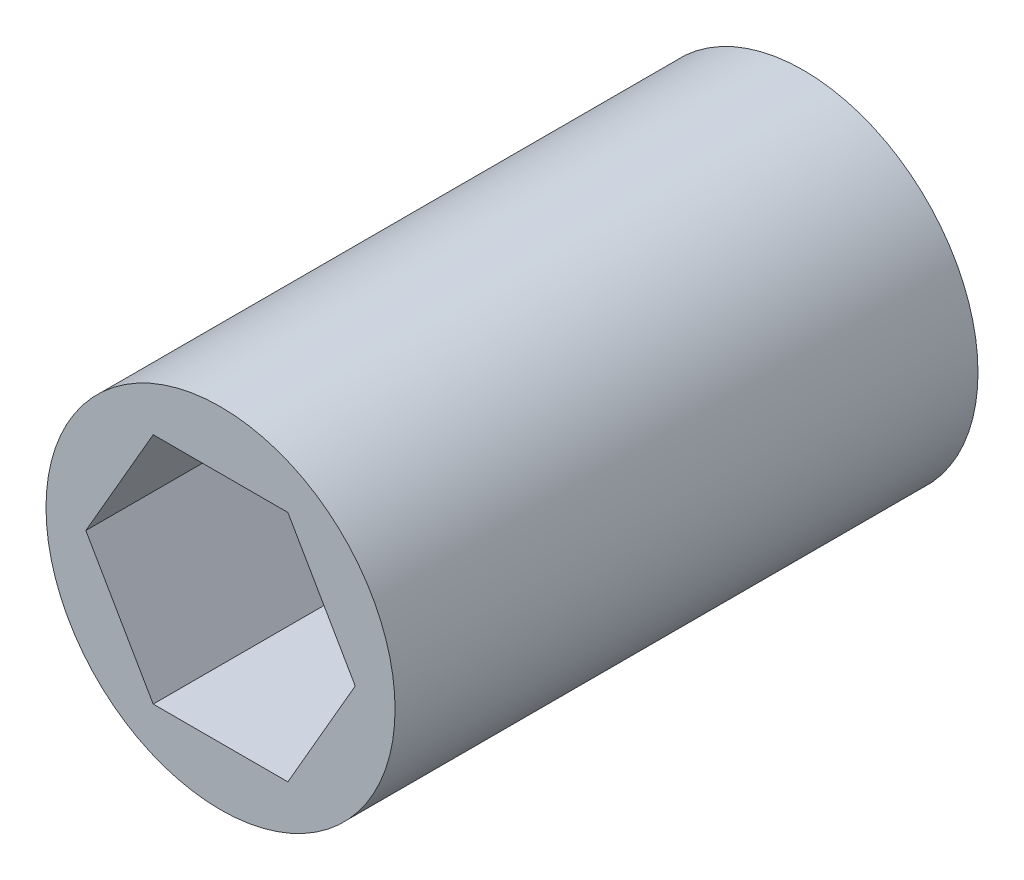
ISO-10303-21;
HEADER;
FILE_DESCRIPTION(('STEP AP214'),'2;1');
FILE_NAME('part.step','',(''),(''),'','','');
FILE_SCHEMA(('AUTOMOTIVE_DESIGN { 1 0 10303 214 1 1 1 1 }'));
ENDSEC;
DATA;
#1=APPLICATION_CONTEXT('core data for automotive mechanical design processes');
#2=APPLICATION_PROTOCOL_DEFINITION('international standard','automotive_design',2000,#1);
#3=PRODUCT_CONTEXT('',#1,'mechanical');
#4=PRODUCT('Part','Part','',(#3));
#5=PRODUCT_RELATED_PRODUCT_CATEGORY('part','',(#4));
#6=PRODUCT_DEFINITION_FORMATION('','',#4);
#7=PRODUCT_DEFINITION_CONTEXT('part definition',#1,'design');
#8=PRODUCT_DEFINITION('design','',#6,#7);
#9=PRODUCT_DEFINITION_SHAPE('','',#8);
#10=(LENGTH_UNIT() NAMED_UNIT(*) SI_UNIT(.MILLI.,.METRE.));
#11=(NAMED_UNIT(*) PLANE_ANGLE_UNIT() SI_UNIT($,.RADIAN.));
#12=(NAMED_UNIT(*) SI_UNIT($,.STERADIAN.) SOLID_ANGLE_UNIT());
#13=UNCERTAINTY_MEASURE_WITH_UNIT(LENGTH_MEASURE(1.E-05),#10,'distance_accuracy_value','');
#14=(GEOMETRIC_REPRESENTATION_CONTEXT(3) GLOBAL_UNCERTAINTY_ASSIGNED_CONTEXT((#13)) GLOBAL_UNIT_ASSIGNED_CONTEXT((#10,
#11,#12)) REPRESENTATION_CONTEXT('',''));
#15=CARTESIAN_POINT('',(0.,0.,0.));
#16=DIRECTION('',(0.,0.,1.));
#17=DIRECTION('',(1.,0.,0.));
#18=AXIS2_PLACEMENT_3D('',#15,#16,#17);
#19=CARTESIAN_POINT('',(0.,0.,12.525));
#20=DIRECTION('',(0.,0.,1.));
#21=DIRECTION('',(1.,0.,0.));
#22=AXIS2_PLACEMENT_3D('',#19,#20,#21);
#23=PLANE('',#22);
#24=CARTESIAN_POINT('',(0.,0.,12.525));
#25=DIRECTION('',(0.,0.,1.));
#26=DIRECTION('',(1.,0.,0.));
#27=AXIS2_PLACEMENT_3D('',#24,#25,#26);
#28=CIRCLE('',#27,7.5);
#29=CARTESIAN_POINT('',(7.5,0.,12.525));
#30=VERTEX_POINT('',#29);
#31=EDGE_CURVE('E11',#30,#30,#28,.T.);
#32=ORIENTED_EDGE('',*,*,#31,.T.);
#33=EDGE_LOOP('',(#32));
#34=FACE_BOUND('',#33,.T.);
#35=DIRECTION('',(-0.5,0.866025403784438,0.));
#36=VECTOR('',#35,1.);
#37=CARTESIAN_POINT('',(5.787936448626,0.,12.525));
#38=LINE('',#37,#36);
#39=CARTESIAN_POINT('',(5.787936448626,0.,12.525));
#40=VERTEX_POINT('',#39);
#41=CARTESIAN_POINT('',(2.893968224313,5.0125,12.525));
#42=VERTEX_POINT('',#41);
#43=EDGE_CURVE('E100',#40,#42,#38,.T.);
#44=ORIENTED_EDGE('',*,*,#43,.F.);
#45=DIRECTION('',(0.5,0.866025403784438,0.));
#46=VECTOR('',#45,1.);
#47=CARTESIAN_POINT('',(2.893968224313,-5.0125,12.525));
#48=LINE('',#47,#46);
#49=CARTESIAN_POINT('',(2.893968224313,-5.0125,12.525));
#50=VERTEX_POINT('',#49);
#51=EDGE_CURVE('E92',#50,#40,#48,.T.);
#52=ORIENTED_EDGE('',*,*,#51,.F.);
#53=DIRECTION('',(1.,0.,0.));
#54=VECTOR('',#53,1.);
#55=CARTESIAN_POINT('',(-2.893968224313,-5.0125,12.525));
#56=LINE('',#55,#54);
#57=CARTESIAN_POINT('',(-2.893968224313,-5.0125,12.525));
#58=VERTEX_POINT('',#57);
#59=EDGE_CURVE('E120',#58,#50,#56,.T.);
#60=ORIENTED_EDGE('',*,*,#59,.F.);
#61=DIRECTION('',(0.5,-0.866025403784439,0.));
#62=VECTOR('',#61,1.);
#63=CARTESIAN_POINT('',(-5.787936448626,0.,12.525));
#64=LINE('',#63,#62);
#65=CARTESIAN_POINT('',(-5.787936448626,0.,12.525));
#66=VERTEX_POINT('',#65);
#67=EDGE_CURVE('E118',#66,#58,#64,.T.);
#68=ORIENTED_EDGE('',*,*,#67,.F.);
#69=DIRECTION('',(-0.5,-0.866025403784438,0.));
#70=VECTOR('',#69,1.);
#71=CARTESIAN_POINT('',(-2.893968224313,5.0125,12.525));
#72=LINE('',#71,#70);
#73=CARTESIAN_POINT('',(-2.893968224313,5.0125,12.525));
#74=VERTEX_POINT('',#73);
#75=EDGE_CURVE('E114',#74,#66,#72,.T.);
#76=ORIENTED_EDGE('',*,*,#75,.F.);
#77=DIRECTION('',(-1.,0.,0.));
#78=VECTOR('',#77,1.);
#79=CARTESIAN_POINT('',(2.893968224313,5.0125,12.525));
#80=LINE('',#79,#78);
#81=EDGE_CURVE('E112',#42,#74,#80,.T.);
#82=ORIENTED_EDGE('',*,*,#81,.F.);
#83=EDGE_LOOP('',(#44,#52,#60,#68,#76,#82));
#84=FACE_BOUND('',#83,.T.);
#85=ADVANCED_FACE('F39',(#34,#84),#23,.T.);
#86=CARTESIAN_POINT('',(0.,0.,-12.525));
#87=DIRECTION('',(0.,0.,1.));
#88=DIRECTION('',(1.,0.,0.));
#89=AXIS2_PLACEMENT_3D('',#86,#87,#88);
#90=PLANE('',#89);
#91=CARTESIAN_POINT('',(0.,0.,-12.525));
#92=DIRECTION('',(0.,0.,1.));
#93=DIRECTION('',(1.,0.,0.));
#94=AXIS2_PLACEMENT_3D('',#91,#92,#93);
#95=CIRCLE('',#94,7.5);
#96=CARTESIAN_POINT('',(7.5,0.,-12.525));
#97=VERTEX_POINT('',#96);
#98=EDGE_CURVE('E43',#97,#97,#95,.T.);
#99=ORIENTED_EDGE('',*,*,#98,.F.);
#100=EDGE_LOOP('',(#99));
#101=FACE_BOUND('',#100,.T.);
#102=DIRECTION('',(0.5,0.866025403784438,0.));
#103=VECTOR('',#102,1.);
#104=CARTESIAN_POINT('',(2.893968224313,-5.0125,-12.525));
#105=LINE('',#104,#103);
#106=CARTESIAN_POINT('',(2.893968224313,-5.0125,-12.525));
#107=VERTEX_POINT('',#106);
#108=CARTESIAN_POINT('',(5.787936448626,0.,-12.525));
#109=VERTEX_POINT('',#108);
#110=EDGE_CURVE('E62',#107,#109,#105,.T.);
#111=ORIENTED_EDGE('',*,*,#110,.T.);
#112=DIRECTION('',(-0.5,0.866025403784438,0.));
#113=VECTOR('',#112,1.);
#114=CARTESIAN_POINT('',(5.787936448626,0.,-12.525));
#115=LINE('',#114,#113);
#116=CARTESIAN_POINT('',(2.893968224313,5.0125,-12.525));
#117=VERTEX_POINT('',#116);
#118=EDGE_CURVE('E107',#109,#117,#115,.T.);
#119=ORIENTED_EDGE('',*,*,#118,.T.);
#120=DIRECTION('',(-1.,0.,0.));
#121=VECTOR('',#120,1.);
#122=CARTESIAN_POINT('',(2.893968224313,5.0125,-12.525));
#123=LINE('',#122,#121);
#124=CARTESIAN_POINT('',(-2.893968224313,5.0125,-12.525));
#125=VERTEX_POINT('',#124);
#126=EDGE_CURVE('E124',#117,#125,#123,.T.);
#127=ORIENTED_EDGE('',*,*,#126,.T.);
#128=DIRECTION('',(-0.5,-0.866025403784438,0.));
#129=VECTOR('',#128,1.);
#130=CARTESIAN_POINT('',(-2.893968224313,5.0125,-12.525));
#131=LINE('',#130,#129);
#132=CARTESIAN_POINT('',(-5.787936448626,0.,-12.525));
#133=VERTEX_POINT('',#132);
#134=EDGE_CURVE('E127',#125,#133,#131,.T.);
#135=ORIENTED_EDGE('',*,*,#134,.T.);
#136=DIRECTION('',(0.5,-0.866025403784439,0.));
#137=VECTOR('',#136,1.);
#138=CARTESIAN_POINT('',(-5.787936448626,0.,-12.525));
#139=LINE('',#138,#137);
#140=CARTESIAN_POINT('',(-2.893968224313,-5.0125,-12.525));
#141=VERTEX_POINT('',#140);
#142=EDGE_CURVE('E130',#133,#141,#139,.T.);
#143=ORIENTED_EDGE('',*,*,#142,.T.);
#144=DIRECTION('',(1.,0.,0.));
#145=VECTOR('',#144,1.);
#146=CARTESIAN_POINT('',(-2.893968224313,-5.0125,-12.525));
#147=LINE('',#146,#145);
#148=EDGE_CURVE('E101',#141,#107,#147,.T.);
#149=ORIENTED_EDGE('',*,*,#148,.T.);
#150=EDGE_LOOP('',(#111,#119,#127,#135,#143,#149));
#151=FACE_BOUND('',#150,.T.);
#152=ADVANCED_FACE('F147',(#101,#151),#90,.F.);
#153=CARTESIAN_POINT('',(0.,0.,12.525));
#154=DIRECTION('',(0.,0.,-1.));
#155=DIRECTION('',(-1.,0.,0.));
#156=AXIS2_PLACEMENT_3D('',#153,#154,#155);
#157=CYLINDRICAL_SURFACE('',#156,7.5);
#158=ORIENTED_EDGE('',*,*,#31,.F.);
#159=EDGE_LOOP('',(#158));
#160=FACE_BOUND('',#159,.T.);
#161=ORIENTED_EDGE('',*,*,#98,.T.);
#162=EDGE_LOOP('',(#161));
#163=FACE_BOUND('',#162,.T.);
#164=ADVANCED_FACE('F41',(#160,#163),#157,.T.);
#165=CARTESIAN_POINT('',(2.893968224313,-5.0125,12.525));
#166=DIRECTION('',(-0.866025403784438,0.5,0.));
#167=DIRECTION('',(-0.5,-0.866025403784439,0.));
#168=AXIS2_PLACEMENT_3D('',#165,#166,#167);
#169=PLANE('',#168);
#170=ORIENTED_EDGE('',*,*,#110,.F.);
#171=DIRECTION('',(0.,0.,-1.));
#172=VECTOR('',#171,1.);
#173=CARTESIAN_POINT('',(2.893968224313,-5.0125,12.525));
#174=LINE('',#173,#172);
#175=EDGE_CURVE('E96',#50,#107,#174,.T.);
#176=ORIENTED_EDGE('',*,*,#175,.F.);
#177=ORIENTED_EDGE('',*,*,#51,.T.);
#178=DIRECTION('',(0.,0.,-1.));
#179=VECTOR('',#178,1.);
#180=CARTESIAN_POINT('',(5.787936448626,0.,12.525));
#181=LINE('',#180,#179);
#182=EDGE_CURVE('E95',#40,#109,#181,.T.);
#183=ORIENTED_EDGE('',*,*,#182,.T.);
#184=EDGE_LOOP('',(#170,#176,#177,#183));
#185=FACE_BOUND('',#184,.T.);
#186=ADVANCED_FACE('F94',(#185),#169,.T.);
#187=CARTESIAN_POINT('',(5.787936448626,0.,12.525));
#188=DIRECTION('',(-0.866025403784438,-0.5,0.));
#189=DIRECTION('',(0.5,-0.866025403784439,0.));
#190=AXIS2_PLACEMENT_3D('',#187,#188,#189);
#191=PLANE('',#190);
#192=ORIENTED_EDGE('',*,*,#118,.F.);
#193=ORIENTED_EDGE('',*,*,#182,.F.);
#194=ORIENTED_EDGE('',*,*,#43,.T.);
#195=DIRECTION('',(0.,0.,-1.));
#196=VECTOR('',#195,1.);
#197=CARTESIAN_POINT('',(2.893968224313,5.0125,12.525));
#198=LINE('',#197,#196);
#199=EDGE_CURVE('E108',#42,#117,#198,.T.);
#200=ORIENTED_EDGE('',*,*,#199,.T.);
#201=EDGE_LOOP('',(#192,#193,#194,#200));
#202=FACE_BOUND('',#201,.T.);
#203=ADVANCED_FACE('F104',(#202),#191,.T.);
#204=CARTESIAN_POINT('',(2.893968224313,5.0125,12.525));
#205=DIRECTION('',(0.,-1.,0.));
#206=DIRECTION('',(1.,0.,0.));
#207=AXIS2_PLACEMENT_3D('',#204,#205,#206);
#208=PLANE('',#207);
#209=ORIENTED_EDGE('',*,*,#126,.F.);
#210=ORIENTED_EDGE('',*,*,#199,.F.);
#211=ORIENTED_EDGE('',*,*,#81,.T.);
#212=DIRECTION('',(0.,0.,-1.));
#213=VECTOR('',#212,1.);
#214=CARTESIAN_POINT('',(-2.893968224313,5.0125,12.525));
#215=LINE('',#214,#213);
#216=EDGE_CURVE('E139',#74,#125,#215,.T.);
#217=ORIENTED_EDGE('',*,*,#216,.T.);
#218=EDGE_LOOP('',(#209,#210,#211,#217));
#219=FACE_BOUND('',#218,.T.);
#220=ADVANCED_FACE('F143',(#219),#208,.T.);
#221=CARTESIAN_POINT('',(-2.893968224313,5.0125,12.525));
#222=DIRECTION('',(0.866025403784438,-0.5,0.));
#223=DIRECTION('',(0.5,0.866025403784439,0.));
#224=AXIS2_PLACEMENT_3D('',#221,#222,#223);
#225=PLANE('',#224);
#226=ORIENTED_EDGE('',*,*,#134,.F.);
#227=ORIENTED_EDGE('',*,*,#216,.F.);
#228=ORIENTED_EDGE('',*,*,#75,.T.);
#229=DIRECTION('',(0.,0.,-1.));
#230=VECTOR('',#229,1.);
#231=CARTESIAN_POINT('',(-5.787936448626,0.,12.525));
#232=LINE('',#231,#230);
#233=EDGE_CURVE('E137',#66,#133,#232,.T.);
#234=ORIENTED_EDGE('',*,*,#233,.T.);
#235=EDGE_LOOP('',(#226,#227,#228,#234));
#236=FACE_BOUND('',#235,.T.);
#237=ADVANCED_FACE('F155',(#236),#225,.T.);
#238=CARTESIAN_POINT('',(-5.787936448626,0.,12.525));
#239=DIRECTION('',(0.866025403784439,0.5,0.));
#240=DIRECTION('',(-0.5,0.866025403784439,0.));
#241=AXIS2_PLACEMENT_3D('',#238,#239,#240);
#242=PLANE('',#241);
#243=ORIENTED_EDGE('',*,*,#142,.F.);
#244=ORIENTED_EDGE('',*,*,#233,.F.);
#245=ORIENTED_EDGE('',*,*,#67,.T.);
#246=DIRECTION('',(0.,0.,-1.));
#247=VECTOR('',#246,1.);
#248=CARTESIAN_POINT('',(-2.893968224313,-5.0125,12.525));
#249=LINE('',#248,#247);
#250=EDGE_CURVE('E54',#58,#141,#249,.T.);
#251=ORIENTED_EDGE('',*,*,#250,.T.);
#252=EDGE_LOOP('',(#243,#244,#245,#251));
#253=FACE_BOUND('',#252,.T.);
#254=ADVANCED_FACE('F153',(#253),#242,.T.);
#255=CARTESIAN_POINT('',(-2.893968224313,-5.0125,12.525));
#256=DIRECTION('',(0.,1.,0.));
#257=DIRECTION('',(-1.,0.,0.));
#258=AXIS2_PLACEMENT_3D('',#255,#256,#257);
#259=PLANE('',#258);
#260=ORIENTED_EDGE('',*,*,#148,.F.);
#261=ORIENTED_EDGE('',*,*,#250,.F.);
#262=ORIENTED_EDGE('',*,*,#59,.T.);
#263=ORIENTED_EDGE('',*,*,#175,.T.);
#264=EDGE_LOOP('',(#260,#261,#262,#263));
#265=FACE_BOUND('',#264,.T.);
#266=ADVANCED_FACE('F149',(#265),#259,.T.);
#267=CLOSED_SHELL('',(#85,#152,#164,#186,#203,#220,#237,#254,#266));
#268=MANIFOLD_SOLID_BREP('B2',#267);
#269=ADVANCED_BREP_SHAPE_REPRESENTATION('',(#18,#268),#14);
#270=SHAPE_DEFINITION_REPRESENTATION(#9,#269);
ENDSEC;
END-ISO-10303-21;
